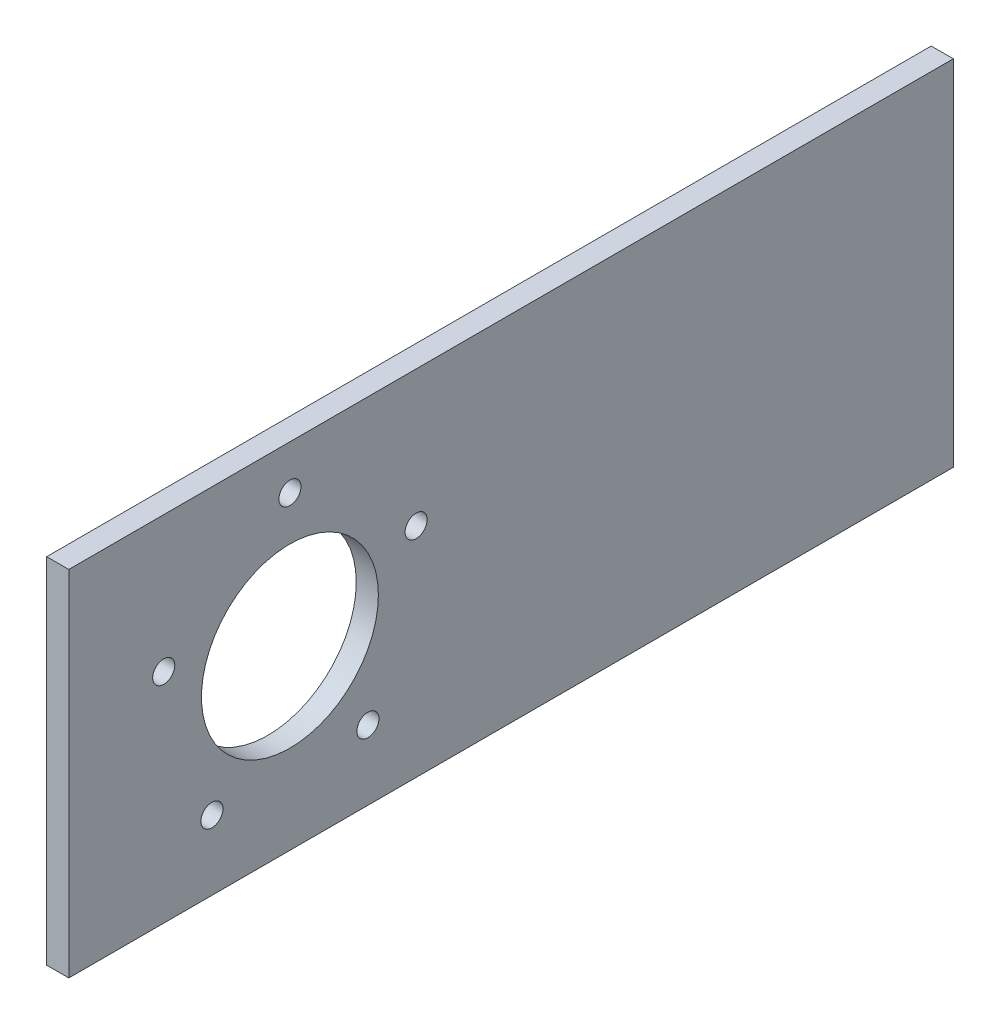
ISO-10303-21;
HEADER;
FILE_DESCRIPTION(('STEP AP214'),'2;1');
FILE_NAME('part.step','',(''),(''),'','','');
FILE_SCHEMA(('AUTOMOTIVE_DESIGN { 1 0 10303 214 1 1 1 1 }'));
ENDSEC;
DATA;
#1=APPLICATION_CONTEXT('core data for automotive mechanical design processes');
#2=APPLICATION_PROTOCOL_DEFINITION('international standard','automotive_design',2000,#1);
#3=PRODUCT_CONTEXT('',#1,'mechanical');
#4=PRODUCT('Part','Part','',(#3));
#5=PRODUCT_RELATED_PRODUCT_CATEGORY('part','',(#4));
#6=PRODUCT_DEFINITION_FORMATION('','',#4);
#7=PRODUCT_DEFINITION_CONTEXT('part definition',#1,'design');
#8=PRODUCT_DEFINITION('design','',#6,#7);
#9=PRODUCT_DEFINITION_SHAPE('','',#8);
#10=(LENGTH_UNIT() NAMED_UNIT(*) SI_UNIT(.MILLI.,.METRE.));
#11=(NAMED_UNIT(*) PLANE_ANGLE_UNIT() SI_UNIT($,.RADIAN.));
#12=(NAMED_UNIT(*) SI_UNIT($,.STERADIAN.) SOLID_ANGLE_UNIT());
#13=UNCERTAINTY_MEASURE_WITH_UNIT(LENGTH_MEASURE(1.E-05),#10,'distance_accuracy_value','');
#14=(GEOMETRIC_REPRESENTATION_CONTEXT(3) GLOBAL_UNCERTAINTY_ASSIGNED_CONTEXT((#13)) GLOBAL_UNIT_ASSIGNED_CONTEXT((#10,
#11,#12)) REPRESENTATION_CONTEXT('',''));
#15=CARTESIAN_POINT('',(0.,0.,0.));
#16=DIRECTION('',(0.,0.,1.));
#17=DIRECTION('',(1.,0.,0.));
#18=AXIS2_PLACEMENT_3D('',#15,#16,#17);
#19=CARTESIAN_POINT('',(3.175,-50.8,-127.));
#20=DIRECTION('',(1.,0.,0.));
#21=DIRECTION('',(0.,0.,-1.));
#22=AXIS2_PLACEMENT_3D('',#19,#20,#21);
#23=PLANE('',#22);
#24=CARTESIAN_POINT('',(3.175,11.7735474856859,99.7352532708452));
#25=DIRECTION('',(1.,0.,0.));
#26=DIRECTION('',(0.,0.95105651629515,-0.309016994374958));
#27=AXIS2_PLACEMENT_3D('',#24,#25,#26);
#28=CIRCLE('',#27,3.175);
#29=CARTESIAN_POINT('',(3.175,14.793151924923,98.7541243137047));
#30=VERTEX_POINT('',#29);
#31=EDGE_CURVE('E172',#30,#30,#28,.T.);
#32=ORIENTED_EDGE('',*,*,#31,.F.);
#33=EDGE_LOOP('',(#32));
#34=FACE_BOUND('',#33,.T.);
#35=CARTESIAN_POINT('',(3.175,-30.8235474856853,85.8946181123435));
#36=DIRECTION('',(1.,0.,0.));
#37=DIRECTION('',(0.,0.58778525229248,0.809016994374942));
#38=AXIS2_PLACEMENT_3D('',#35,#36,#37);
#39=CIRCLE('',#38,3.175);
#40=CARTESIAN_POINT('',(3.175,-28.9573293096567,88.4632470694839));
#41=VERTEX_POINT('',#40);
#42=EDGE_CURVE('E165',#41,#41,#39,.T.);
#43=ORIENTED_EDGE('',*,*,#42,.F.);
#44=EDGE_LOOP('',(#43));
#45=FACE_BOUND('',#44,.T.);
#46=CARTESIAN_POINT('',(3.175,-30.8235474856856,41.1053818876569));
#47=DIRECTION('',(1.,0.,0.));
#48=DIRECTION('',(0.,-0.587785252292469,0.809016994374951));
#49=AXIS2_PLACEMENT_3D('',#46,#47,#48);
#50=CIRCLE('',#49,3.175);
#51=CARTESIAN_POINT('',(3.175,-32.6897656617142,43.6740108447974));
#52=VERTEX_POINT('',#51);
#53=EDGE_CURVE('E157',#52,#52,#50,.T.);
#54=ORIENTED_EDGE('',*,*,#53,.F.);
#55=EDGE_LOOP('',(#54));
#56=FACE_BOUND('',#55,.T.);
#57=CARTESIAN_POINT('',(3.175,11.7735474856854,27.2647467291546));
#58=DIRECTION('',(1.,0.,0.));
#59=DIRECTION('',(0.,-0.951056516295155,-0.309016994374945));
#60=AXIS2_PLACEMENT_3D('',#57,#58,#59);
#61=CIRCLE('',#60,3.175);
#62=CARTESIAN_POINT('',(3.175,8.7539430464483,26.2836177720142));
#63=VERTEX_POINT('',#62);
#64=EDGE_CURVE('E149',#63,#63,#61,.T.);
#65=ORIENTED_EDGE('',*,*,#64,.F.);
#66=EDGE_LOOP('',(#65));
#67=FACE_BOUND('',#66,.T.);
#68=CARTESIAN_POINT('',(3.175,38.1,63.5));
#69=DIRECTION('',(1.,0.,0.));
#70=DIRECTION('',(0.,0.,-1.));
#71=AXIS2_PLACEMENT_3D('',#68,#69,#70);
#72=CIRCLE('',#71,3.175);
#73=CARTESIAN_POINT('',(3.175,38.1,60.325));
#74=VERTEX_POINT('',#73);
#75=EDGE_CURVE('E141',#74,#74,#72,.T.);
#76=ORIENTED_EDGE('',*,*,#75,.F.);
#77=EDGE_LOOP('',(#76));
#78=FACE_BOUND('',#77,.T.);
#79=DIRECTION('',(0.,1.,0.));
#80=VECTOR('',#79,1.);
#81=CARTESIAN_POINT('',(3.175,50.8,-127.));
#82=LINE('',#81,#80);
#83=CARTESIAN_POINT('',(3.175,-50.8,-127.));
#84=VERTEX_POINT('',#83);
#85=CARTESIAN_POINT('',(3.175,50.8,-127.));
#86=VERTEX_POINT('',#85);
#87=EDGE_CURVE('E95',#84,#86,#82,.T.);
#88=ORIENTED_EDGE('',*,*,#87,.T.);
#89=DIRECTION('',(0.,0.,1.));
#90=VECTOR('',#89,1.);
#91=CARTESIAN_POINT('',(3.175,50.8,127.));
#92=LINE('',#91,#90);
#93=CARTESIAN_POINT('',(3.175,50.8,127.));
#94=VERTEX_POINT('',#93);
#95=EDGE_CURVE('E90',#86,#94,#92,.T.);
#96=ORIENTED_EDGE('',*,*,#95,.T.);
#97=DIRECTION('',(0.,-1.,0.));
#98=VECTOR('',#97,1.);
#99=CARTESIAN_POINT('',(3.175,50.8,127.));
#100=LINE('',#99,#98);
#101=CARTESIAN_POINT('',(3.175,-50.8,127.));
#102=VERTEX_POINT('',#101);
#103=EDGE_CURVE('E93',#94,#102,#100,.T.);
#104=ORIENTED_EDGE('',*,*,#103,.T.);
#105=DIRECTION('',(0.,0.,-1.));
#106=VECTOR('',#105,1.);
#107=CARTESIAN_POINT('',(3.175,-50.8,127.));
#108=LINE('',#107,#106);
#109=EDGE_CURVE('E59',#102,#84,#108,.T.);
#110=ORIENTED_EDGE('',*,*,#109,.T.);
#111=EDGE_LOOP('',(#88,#96,#104,#110));
#112=FACE_BOUND('',#111,.T.);
#113=CARTESIAN_POINT('',(3.175,0.,63.5));
#114=DIRECTION('',(1.,0.,0.));
#115=DIRECTION('',(0.,0.,-1.));
#116=AXIS2_PLACEMENT_3D('',#113,#114,#115);
#117=CIRCLE('',#116,25.4);
#118=CARTESIAN_POINT('',(3.175,0.,38.1));
#119=VERTEX_POINT('',#118);
#120=EDGE_CURVE('E116',#119,#119,#117,.T.);
#121=ORIENTED_EDGE('',*,*,#120,.F.);
#122=EDGE_LOOP('',(#121));
#123=FACE_BOUND('',#122,.T.);
#124=ADVANCED_FACE('F39',(#34,#45,#56,#67,#78,#112,#123),#23,.T.);
#125=CARTESIAN_POINT('',(-3.175,-50.8,-127.));
#126=DIRECTION('',(1.,0.,0.));
#127=DIRECTION('',(0.,0.,-1.));
#128=AXIS2_PLACEMENT_3D('',#125,#126,#127);
#129=PLANE('',#128);
#130=CARTESIAN_POINT('',(-3.175,11.7735474856859,99.7352532708452));
#131=DIRECTION('',(1.,0.,0.));
#132=DIRECTION('',(0.,0.95105651629515,-0.309016994374958));
#133=AXIS2_PLACEMENT_3D('',#130,#131,#132);
#134=CIRCLE('',#133,3.175);
#135=CARTESIAN_POINT('',(-3.175,14.793151924923,98.7541243137047));
#136=VERTEX_POINT('',#135);
#137=EDGE_CURVE('E169',#136,#136,#134,.T.);
#138=ORIENTED_EDGE('',*,*,#137,.T.);
#139=EDGE_LOOP('',(#138));
#140=FACE_BOUND('',#139,.T.);
#141=CARTESIAN_POINT('',(-3.175,-30.8235474856853,85.8946181123435));
#142=DIRECTION('',(1.,0.,0.));
#143=DIRECTION('',(0.,0.58778525229248,0.809016994374942));
#144=AXIS2_PLACEMENT_3D('',#141,#142,#143);
#145=CIRCLE('',#144,3.175);
#146=CARTESIAN_POINT('',(-3.175,-28.9573293096567,88.4632470694839));
#147=VERTEX_POINT('',#146);
#148=EDGE_CURVE('E161',#147,#147,#145,.T.);
#149=ORIENTED_EDGE('',*,*,#148,.T.);
#150=EDGE_LOOP('',(#149));
#151=FACE_BOUND('',#150,.T.);
#152=CARTESIAN_POINT('',(-3.175,-30.8235474856856,41.1053818876569));
#153=DIRECTION('',(1.,0.,0.));
#154=DIRECTION('',(0.,-0.587785252292469,0.809016994374951));
#155=AXIS2_PLACEMENT_3D('',#152,#153,#154);
#156=CIRCLE('',#155,3.175);
#157=CARTESIAN_POINT('',(-3.175,-32.6897656617142,43.6740108447974));
#158=VERTEX_POINT('',#157);
#159=EDGE_CURVE('E153',#158,#158,#156,.T.);
#160=ORIENTED_EDGE('',*,*,#159,.T.);
#161=EDGE_LOOP('',(#160));
#162=FACE_BOUND('',#161,.T.);
#163=CARTESIAN_POINT('',(-3.175,11.7735474856854,27.2647467291546));
#164=DIRECTION('',(1.,0.,0.));
#165=DIRECTION('',(0.,-0.951056516295155,-0.309016994374945));
#166=AXIS2_PLACEMENT_3D('',#163,#164,#165);
#167=CIRCLE('',#166,3.175);
#168=CARTESIAN_POINT('',(-3.175,8.7539430464483,26.2836177720142));
#169=VERTEX_POINT('',#168);
#170=EDGE_CURVE('E145',#169,#169,#167,.T.);
#171=ORIENTED_EDGE('',*,*,#170,.T.);
#172=EDGE_LOOP('',(#171));
#173=FACE_BOUND('',#172,.T.);
#174=CARTESIAN_POINT('',(-3.175,38.1,63.5));
#175=DIRECTION('',(1.,0.,0.));
#176=DIRECTION('',(0.,0.,-1.));
#177=AXIS2_PLACEMENT_3D('',#174,#175,#176);
#178=CIRCLE('',#177,3.175);
#179=CARTESIAN_POINT('',(-3.175,38.1,60.325));
#180=VERTEX_POINT('',#179);
#181=EDGE_CURVE('E137',#180,#180,#178,.T.);
#182=ORIENTED_EDGE('',*,*,#181,.T.);
#183=EDGE_LOOP('',(#182));
#184=FACE_BOUND('',#183,.T.);
#185=DIRECTION('',(0.,1.,0.));
#186=VECTOR('',#185,1.);
#187=CARTESIAN_POINT('',(-3.175,50.8,-127.));
#188=LINE('',#187,#186);
#189=CARTESIAN_POINT('',(-3.175,-50.8,-127.));
#190=VERTEX_POINT('',#189);
#191=CARTESIAN_POINT('',(-3.175,50.8,-127.));
#192=VERTEX_POINT('',#191);
#193=EDGE_CURVE('E112',#190,#192,#188,.T.);
#194=ORIENTED_EDGE('',*,*,#193,.F.);
#195=DIRECTION('',(0.,0.,-1.));
#196=VECTOR('',#195,1.);
#197=CARTESIAN_POINT('',(-3.175,-50.8,127.));
#198=LINE('',#197,#196);
#199=CARTESIAN_POINT('',(-3.175,-50.8,127.));
#200=VERTEX_POINT('',#199);
#201=EDGE_CURVE('E83',#200,#190,#198,.T.);
#202=ORIENTED_EDGE('',*,*,#201,.F.);
#203=DIRECTION('',(0.,-1.,0.));
#204=VECTOR('',#203,1.);
#205=CARTESIAN_POINT('',(-3.175,50.8,127.));
#206=LINE('',#205,#204);
#207=CARTESIAN_POINT('',(-3.175,50.8,127.));
#208=VERTEX_POINT('',#207);
#209=EDGE_CURVE('E77',#208,#200,#206,.T.);
#210=ORIENTED_EDGE('',*,*,#209,.F.);
#211=DIRECTION('',(0.,0.,1.));
#212=VECTOR('',#211,1.);
#213=CARTESIAN_POINT('',(-3.175,50.8,127.));
#214=LINE('',#213,#212);
#215=EDGE_CURVE('E100',#192,#208,#214,.T.);
#216=ORIENTED_EDGE('',*,*,#215,.F.);
#217=EDGE_LOOP('',(#194,#202,#210,#216));
#218=FACE_BOUND('',#217,.T.);
#219=CARTESIAN_POINT('',(-3.175,0.,63.5));
#220=DIRECTION('',(1.,0.,0.));
#221=DIRECTION('',(0.,0.,-1.));
#222=AXIS2_PLACEMENT_3D('',#219,#220,#221);
#223=CIRCLE('',#222,25.4);
#224=CARTESIAN_POINT('',(-3.175,0.,38.1));
#225=VERTEX_POINT('',#224);
#226=EDGE_CURVE('E133',#225,#225,#223,.T.);
#227=ORIENTED_EDGE('',*,*,#226,.T.);
#228=EDGE_LOOP('',(#227));
#229=FACE_BOUND('',#228,.T.);
#230=ADVANCED_FACE('F127',(#140,#151,#162,#173,#184,#218,#229),#129,.F.);
#231=CARTESIAN_POINT('',(3.175,50.8,-127.));
#232=DIRECTION('',(0.,0.,1.));
#233=DIRECTION('',(0.,-1.,0.));
#234=AXIS2_PLACEMENT_3D('',#231,#232,#233);
#235=PLANE('',#234);
#236=ORIENTED_EDGE('',*,*,#193,.T.);
#237=DIRECTION('',(-1.,0.,0.));
#238=VECTOR('',#237,1.);
#239=CARTESIAN_POINT('',(3.175,50.8,-127.));
#240=LINE('',#239,#238);
#241=EDGE_CURVE('E11',#86,#192,#240,.T.);
#242=ORIENTED_EDGE('',*,*,#241,.F.);
#243=ORIENTED_EDGE('',*,*,#87,.F.);
#244=DIRECTION('',(-1.,0.,0.));
#245=VECTOR('',#244,1.);
#246=CARTESIAN_POINT('',(3.175,-50.8,-127.));
#247=LINE('',#246,#245);
#248=EDGE_CURVE('E108',#84,#190,#247,.T.);
#249=ORIENTED_EDGE('',*,*,#248,.T.);
#250=EDGE_LOOP('',(#236,#242,#243,#249));
#251=FACE_BOUND('',#250,.T.);
#252=ADVANCED_FACE('F41',(#251),#235,.F.);
#253=CARTESIAN_POINT('',(3.175,50.8,127.));
#254=DIRECTION('',(0.,-1.,0.));
#255=DIRECTION('',(0.,0.,-1.));
#256=AXIS2_PLACEMENT_3D('',#253,#254,#255);
#257=PLANE('',#256);
#258=ORIENTED_EDGE('',*,*,#215,.T.);
#259=DIRECTION('',(-1.,0.,0.));
#260=VECTOR('',#259,1.);
#261=CARTESIAN_POINT('',(3.175,50.8,127.));
#262=LINE('',#261,#260);
#263=EDGE_CURVE('E48',#94,#208,#262,.T.);
#264=ORIENTED_EDGE('',*,*,#263,.F.);
#265=ORIENTED_EDGE('',*,*,#95,.F.);
#266=ORIENTED_EDGE('',*,*,#241,.T.);
#267=EDGE_LOOP('',(#258,#264,#265,#266));
#268=FACE_BOUND('',#267,.T.);
#269=ADVANCED_FACE('F99',(#268),#257,.F.);
#270=CARTESIAN_POINT('',(3.175,50.8,127.));
#271=DIRECTION('',(0.,0.,-1.));
#272=DIRECTION('',(0.,1.,0.));
#273=AXIS2_PLACEMENT_3D('',#270,#271,#272);
#274=PLANE('',#273);
#275=ORIENTED_EDGE('',*,*,#209,.T.);
#276=DIRECTION('',(-1.,0.,0.));
#277=VECTOR('',#276,1.);
#278=CARTESIAN_POINT('',(3.175,-50.8,127.));
#279=LINE('',#278,#277);
#280=EDGE_CURVE('E101',#102,#200,#279,.T.);
#281=ORIENTED_EDGE('',*,*,#280,.F.);
#282=ORIENTED_EDGE('',*,*,#103,.F.);
#283=ORIENTED_EDGE('',*,*,#263,.T.);
#284=EDGE_LOOP('',(#275,#281,#282,#283));
#285=FACE_BOUND('',#284,.T.);
#286=ADVANCED_FACE('F102',(#285),#274,.F.);
#287=CARTESIAN_POINT('',(3.175,-50.8,127.));
#288=DIRECTION('',(0.,1.,0.));
#289=DIRECTION('',(0.,0.,1.));
#290=AXIS2_PLACEMENT_3D('',#287,#288,#289);
#291=PLANE('',#290);
#292=ORIENTED_EDGE('',*,*,#201,.T.);
#293=ORIENTED_EDGE('',*,*,#248,.F.);
#294=ORIENTED_EDGE('',*,*,#109,.F.);
#295=ORIENTED_EDGE('',*,*,#280,.T.);
#296=EDGE_LOOP('',(#292,#293,#294,#295));
#297=FACE_BOUND('',#296,.T.);
#298=ADVANCED_FACE('F124',(#297),#291,.F.);
#299=CARTESIAN_POINT('',(3.175,0.,63.5));
#300=DIRECTION('',(-1.,0.,0.));
#301=DIRECTION('',(0.,0.,1.));
#302=AXIS2_PLACEMENT_3D('',#299,#300,#301);
#303=CYLINDRICAL_SURFACE('',#302,25.4);
#304=ORIENTED_EDGE('',*,*,#120,.T.);
#305=EDGE_LOOP('',(#304));
#306=FACE_BOUND('',#305,.T.);
#307=ORIENTED_EDGE('',*,*,#226,.F.);
#308=EDGE_LOOP('',(#307));
#309=FACE_BOUND('',#308,.T.);
#310=ADVANCED_FACE('F203',(#306,#309),#303,.F.);
#311=CARTESIAN_POINT('',(-3.175,38.1,63.5));
#312=DIRECTION('',(1.,0.,0.));
#313=DIRECTION('',(0.,0.,-1.));
#314=AXIS2_PLACEMENT_3D('',#311,#312,#313);
#315=CYLINDRICAL_SURFACE('',#314,3.175);
#316=ORIENTED_EDGE('',*,*,#181,.F.);
#317=EDGE_LOOP('',(#316));
#318=FACE_BOUND('',#317,.T.);
#319=ORIENTED_EDGE('',*,*,#75,.T.);
#320=EDGE_LOOP('',(#319));
#321=FACE_BOUND('',#320,.T.);
#322=ADVANCED_FACE('F200',(#318,#321),#315,.F.);
#323=CARTESIAN_POINT('',(-3.175,11.7735474856854,27.2647467291546));
#324=DIRECTION('',(1.,0.,0.));
#325=DIRECTION('',(0.,0.,-1.));
#326=AXIS2_PLACEMENT_3D('',#323,#324,#325);
#327=CYLINDRICAL_SURFACE('',#326,3.175);
#328=ORIENTED_EDGE('',*,*,#170,.F.);
#329=EDGE_LOOP('',(#328));
#330=FACE_BOUND('',#329,.T.);
#331=ORIENTED_EDGE('',*,*,#64,.T.);
#332=EDGE_LOOP('',(#331));
#333=FACE_BOUND('',#332,.T.);
#334=ADVANCED_FACE('F202',(#330,#333),#327,.F.);
#335=CARTESIAN_POINT('',(-3.175,-30.8235474856856,41.1053818876569));
#336=DIRECTION('',(1.,0.,0.));
#337=DIRECTION('',(0.,0.,-1.));
#338=AXIS2_PLACEMENT_3D('',#335,#336,#337);
#339=CYLINDRICAL_SURFACE('',#338,3.175);
#340=ORIENTED_EDGE('',*,*,#159,.F.);
#341=EDGE_LOOP('',(#340));
#342=FACE_BOUND('',#341,.T.);
#343=ORIENTED_EDGE('',*,*,#53,.T.);
#344=EDGE_LOOP('',(#343));
#345=FACE_BOUND('',#344,.T.);
#346=ADVANCED_FACE('F210',(#342,#345),#339,.F.);
#347=CARTESIAN_POINT('',(-3.175,-30.8235474856853,85.8946181123435));
#348=DIRECTION('',(1.,0.,0.));
#349=DIRECTION('',(0.,0.,-1.));
#350=AXIS2_PLACEMENT_3D('',#347,#348,#349);
#351=CYLINDRICAL_SURFACE('',#350,3.175);
#352=ORIENTED_EDGE('',*,*,#148,.F.);
#353=EDGE_LOOP('',(#352));
#354=FACE_BOUND('',#353,.T.);
#355=ORIENTED_EDGE('',*,*,#42,.T.);
#356=EDGE_LOOP('',(#355));
#357=FACE_BOUND('',#356,.T.);
#358=ADVANCED_FACE('F185',(#354,#357),#351,.F.);
#359=CARTESIAN_POINT('',(-3.175,11.7735474856859,99.7352532708452));
#360=DIRECTION('',(1.,0.,0.));
#361=DIRECTION('',(0.,0.,-1.));
#362=AXIS2_PLACEMENT_3D('',#359,#360,#361);
#363=CYLINDRICAL_SURFACE('',#362,3.175);
#364=ORIENTED_EDGE('',*,*,#137,.F.);
#365=EDGE_LOOP('',(#364));
#366=FACE_BOUND('',#365,.T.);
#367=ORIENTED_EDGE('',*,*,#31,.T.);
#368=EDGE_LOOP('',(#367));
#369=FACE_BOUND('',#368,.T.);
#370=ADVANCED_FACE('F182',(#366,#369),#363,.F.);
#371=CLOSED_SHELL('',(#124,#230,#252,#269,#286,#298,#310,#322,#334,#346,#358,#370));
#372=MANIFOLD_SOLID_BREP('B2',#371);
#373=ADVANCED_BREP_SHAPE_REPRESENTATION('',(#18,#372),#14);
#374=SHAPE_DEFINITION_REPRESENTATION(#9,#373);
ENDSEC;
END-ISO-10303-21;
